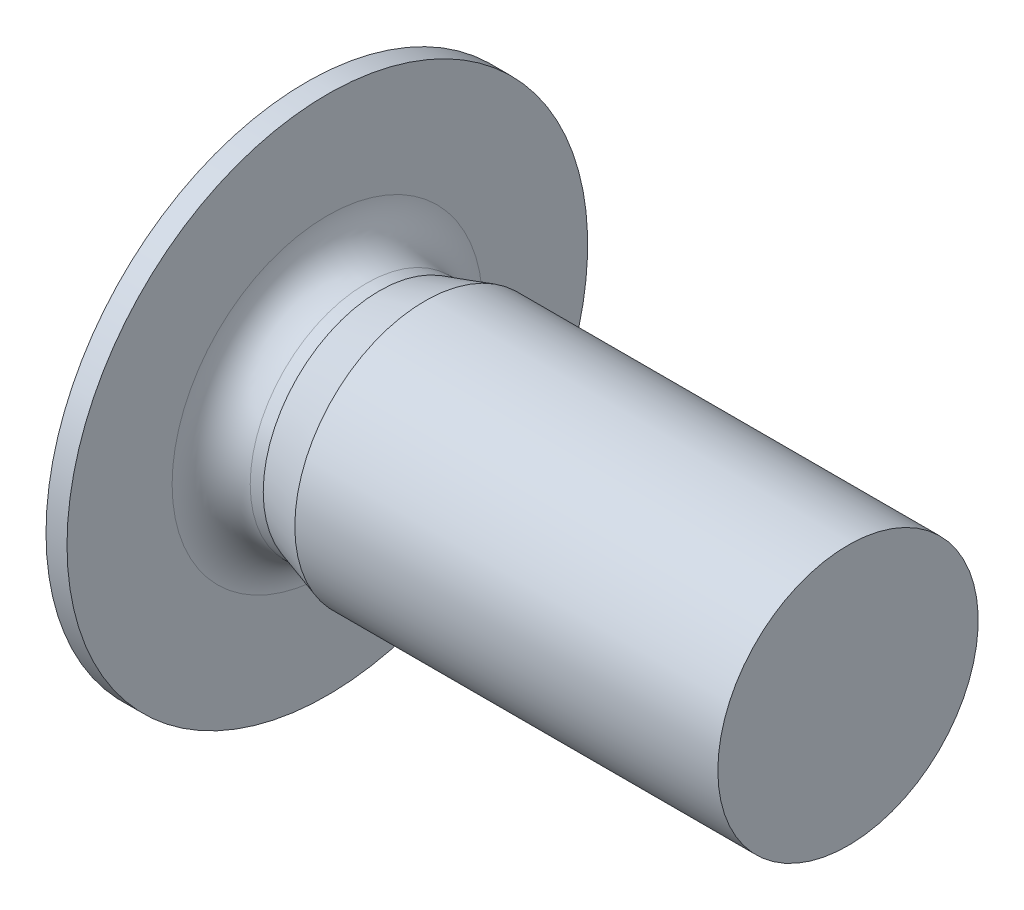
ISO-10303-21;
HEADER;
FILE_DESCRIPTION(('STEP AP214'),'2;1');
FILE_NAME('part.step','',(''),(''),'','','');
FILE_SCHEMA(('AUTOMOTIVE_DESIGN { 1 0 10303 214 1 1 1 1 }'));
ENDSEC;
DATA;
#1=APPLICATION_CONTEXT('core data for automotive mechanical design processes');
#2=APPLICATION_PROTOCOL_DEFINITION('international standard','automotive_design',2000,#1);
#3=PRODUCT_CONTEXT('',#1,'mechanical');
#4=PRODUCT('Part','Part','',(#3));
#5=PRODUCT_RELATED_PRODUCT_CATEGORY('part','',(#4));
#6=PRODUCT_DEFINITION_FORMATION('','',#4);
#7=PRODUCT_DEFINITION_CONTEXT('part definition',#1,'design');
#8=PRODUCT_DEFINITION('design','',#6,#7);
#9=PRODUCT_DEFINITION_SHAPE('','',#8);
#10=(LENGTH_UNIT() NAMED_UNIT(*) SI_UNIT(.MILLI.,.METRE.));
#11=(NAMED_UNIT(*) PLANE_ANGLE_UNIT() SI_UNIT($,.RADIAN.));
#12=(NAMED_UNIT(*) SI_UNIT($,.STERADIAN.) SOLID_ANGLE_UNIT());
#13=UNCERTAINTY_MEASURE_WITH_UNIT(LENGTH_MEASURE(1.E-05),#10,'distance_accuracy_value','');
#14=(GEOMETRIC_REPRESENTATION_CONTEXT(3) GLOBAL_UNCERTAINTY_ASSIGNED_CONTEXT((#13)) GLOBAL_UNIT_ASSIGNED_CONTEXT((#10,
#11,#12)) REPRESENTATION_CONTEXT('',''));
#15=CARTESIAN_POINT('',(0.,0.,0.));
#16=DIRECTION('',(0.,0.,1.));
#17=DIRECTION('',(1.,0.,0.));
#18=AXIS2_PLACEMENT_3D('',#15,#16,#17);
#19=CARTESIAN_POINT('',(0.6,0.,0.));
#20=DIRECTION('',(-1.,0.,0.));
#21=DIRECTION('',(0.,0.,1.));
#22=AXIS2_PLACEMENT_3D('',#19,#20,#21);
#23=TOROIDAL_SURFACE('',#22,2.385,0.6);
#24=CARTESIAN_POINT('',(0.6,0.,0.));
#25=DIRECTION('',(1.,0.,0.));
#26=DIRECTION('',(0.,0.,1.));
#27=AXIS2_PLACEMENT_3D('',#24,#25,#26);
#28=CIRCLE('',#27,1.785);
#29=CARTESIAN_POINT('',(0.6,0.,1.785));
#30=VERTEX_POINT('',#29);
#31=EDGE_CURVE('E205',#30,#30,#28,.T.);
#32=ORIENTED_EDGE('',*,*,#31,.F.);
#33=EDGE_LOOP('',(#32));
#34=FACE_BOUND('',#33,.T.);
#35=CARTESIAN_POINT('',(0.,0.,0.));
#36=DIRECTION('',(-1.,0.,0.));
#37=DIRECTION('',(0.,0.,1.));
#38=AXIS2_PLACEMENT_3D('',#35,#36,#37);
#39=CIRCLE('',#38,2.385);
#40=CARTESIAN_POINT('',(0.,0.,2.385));
#41=VERTEX_POINT('',#40);
#42=EDGE_CURVE('E209',#41,#41,#39,.T.);
#43=ORIENTED_EDGE('',*,*,#42,.F.);
#44=EDGE_LOOP('',(#43));
#45=FACE_BOUND('',#44,.T.);
#46=ADVANCED_FACE('F16',(#34,#45),#23,.F.);
#47=CARTESIAN_POINT('',(0.4,0.,0.));
#48=DIRECTION('',(-1.,0.,0.));
#49=DIRECTION('',(0.,-1.,0.));
#50=AXIS2_PLACEMENT_3D('',#47,#48,#49);
#51=CONICAL_SURFACE('',#50,1.,1.02974425867665);
#52=CARTESIAN_POINT('',(1.00086061902757,0.,0.));
#53=VERTEX_POINT('',#52);
#54=VERTEX_LOOP('',#53);
#55=FACE_BOUND('',#54,.T.);
#56=CARTESIAN_POINT('',(0.4,0.,0.));
#57=DIRECTION('',(1.,0.,0.));
#58=DIRECTION('',(0.,1.,0.));
#59=AXIS2_PLACEMENT_3D('',#56,#57,#58);
#60=CIRCLE('',#59,1.);
#61=CARTESIAN_POINT('',(0.4,1.,0.));
#62=VERTEX_POINT('',#61);
#63=CARTESIAN_POINT('',(0.4,0.5,0.866025403784439));
#64=VERTEX_POINT('',#63);
#65=EDGE_CURVE('E277',#62,#64,#60,.T.);
#66=ORIENTED_EDGE('',*,*,#65,.F.);
#67=CARTESIAN_POINT('',(0.4,0.,0.));
#68=DIRECTION('',(1.,0.,0.));
#69=DIRECTION('',(0.,0.,1.));
#70=AXIS2_PLACEMENT_3D('',#67,#68,#69);
#71=CIRCLE('',#70,1.);
#72=CARTESIAN_POINT('',(0.4,0.5,-0.866025403784439));
#73=VERTEX_POINT('',#72);
#74=EDGE_CURVE('E265',#73,#62,#71,.T.);
#75=ORIENTED_EDGE('',*,*,#74,.F.);
#76=CARTESIAN_POINT('',(0.4,0.,0.));
#77=DIRECTION('',(1.,0.,0.));
#78=DIRECTION('',(0.,0.,1.));
#79=AXIS2_PLACEMENT_3D('',#76,#77,#78);
#80=CIRCLE('',#79,1.);
#81=CARTESIAN_POINT('',(0.4,-0.5,-0.866025403784439));
#82=VERTEX_POINT('',#81);
#83=EDGE_CURVE('E248',#82,#73,#80,.T.);
#84=ORIENTED_EDGE('',*,*,#83,.F.);
#85=CARTESIAN_POINT('',(0.4,0.,0.));
#86=DIRECTION('',(1.,0.,0.));
#87=DIRECTION('',(0.,0.,1.));
#88=AXIS2_PLACEMENT_3D('',#85,#86,#87);
#89=CIRCLE('',#88,1.);
#90=CARTESIAN_POINT('',(0.4,-1.,0.));
#91=VERTEX_POINT('',#90);
#92=EDGE_CURVE('E241',#91,#82,#89,.T.);
#93=ORIENTED_EDGE('',*,*,#92,.F.);
#94=CARTESIAN_POINT('',(0.4,0.,0.));
#95=DIRECTION('',(1.,0.,0.));
#96=DIRECTION('',(0.,0.,1.));
#97=AXIS2_PLACEMENT_3D('',#94,#95,#96);
#98=CIRCLE('',#97,1.);
#99=CARTESIAN_POINT('',(0.4,-0.5,0.866025403784439));
#100=VERTEX_POINT('',#99);
#101=EDGE_CURVE('E297',#100,#91,#98,.T.);
#102=ORIENTED_EDGE('',*,*,#101,.F.);
#103=CARTESIAN_POINT('',(0.4,0.,0.));
#104=DIRECTION('',(1.,0.,0.));
#105=DIRECTION('',(0.,0.,1.));
#106=AXIS2_PLACEMENT_3D('',#103,#104,#105);
#107=CIRCLE('',#106,1.);
#108=EDGE_CURVE('E10',#64,#100,#107,.T.);
#109=ORIENTED_EDGE('',*,*,#108,.F.);
#110=EDGE_LOOP('',(#66,#75,#84,#93,#102,#109));
#111=FACE_BOUND('',#110,.T.);
#112=ADVANCED_FACE('F691',(#55,#111),#51,.F.);
#113=CARTESIAN_POINT('',(0.4,0.,0.));
#114=DIRECTION('',(-1.,0.,0.));
#115=DIRECTION('',(0.,0.,1.));
#116=AXIS2_PLACEMENT_3D('',#113,#114,#115);
#117=PLANE('',#116);
#118=DIRECTION('',(0.,0.866025403784439,-0.5));
#119=VECTOR('',#118,1.);
#120=CARTESIAN_POINT('',(0.4,0.,1.15470053837925));
#121=LINE('',#120,#119);
#122=CARTESIAN_POINT('',(0.4,0.,1.15470053837925));
#123=VERTEX_POINT('',#122);
#124=EDGE_CURVE('E217',#123,#64,#121,.T.);
#125=ORIENTED_EDGE('',*,*,#124,.T.);
#126=ORIENTED_EDGE('',*,*,#108,.T.);
#127=DIRECTION('',(0.,0.866025403784439,0.5));
#128=VECTOR('',#127,1.);
#129=CARTESIAN_POINT('',(0.4,-1.,0.577350269189626));
#130=LINE('',#129,#128);
#131=EDGE_CURVE('E39',#100,#123,#130,.T.);
#132=ORIENTED_EDGE('',*,*,#131,.T.);
#133=EDGE_LOOP('',(#125,#126,#132));
#134=FACE_BOUND('',#133,.T.);
#135=ADVANCED_FACE('F681',(#134),#117,.T.);
#136=CARTESIAN_POINT('',(0.4,0.,-1.15470053837925));
#137=DIRECTION('',(0.,-0.5,-0.866025403784439));
#138=DIRECTION('',(0.,-0.866025403784439,0.5));
#139=AXIS2_PLACEMENT_3D('',#136,#137,#138);
#140=PLANE('',#139);
#141=DIRECTION('',(0.,-0.866025403784439,0.5));
#142=VECTOR('',#141,1.);
#143=CARTESIAN_POINT('',(-0.9,0.,-1.15470053837925));
#144=LINE('',#143,#142);
#145=CARTESIAN_POINT('',(-0.9,0.,-1.15470053837925));
#146=VERTEX_POINT('',#145);
#147=CARTESIAN_POINT('',(-0.9,-1.,-0.577350269189626));
#148=VERTEX_POINT('',#147);
#149=EDGE_CURVE('E148',#146,#148,#144,.T.);
#150=ORIENTED_EDGE('',*,*,#149,.T.);
#151=DIRECTION('',(-1.,0.,0.));
#152=VECTOR('',#151,1.);
#153=CARTESIAN_POINT('',(0.4,-1.,-0.577350269189626));
#154=LINE('',#153,#152);
#155=CARTESIAN_POINT('',(0.4,-1.,-0.577350269189626));
#156=VERTEX_POINT('',#155);
#157=EDGE_CURVE('E24',#156,#148,#154,.T.);
#158=ORIENTED_EDGE('',*,*,#157,.F.);
#159=DIRECTION('',(0.,-0.866025403784439,0.5));
#160=VECTOR('',#159,1.);
#161=CARTESIAN_POINT('',(0.4,0.,-1.15470053837925));
#162=LINE('',#161,#160);
#163=EDGE_CURVE('E237',#82,#156,#162,.T.);
#164=ORIENTED_EDGE('',*,*,#163,.F.);
#165=DIRECTION('',(0.,-0.866025403784439,0.5));
#166=VECTOR('',#165,1.);
#167=CARTESIAN_POINT('',(0.4,0.,-1.15470053837925));
#168=LINE('',#167,#166);
#169=CARTESIAN_POINT('',(0.4,0.,-1.15470053837925));
#170=VERTEX_POINT('',#169);
#171=EDGE_CURVE('E151',#170,#82,#168,.T.);
#172=ORIENTED_EDGE('',*,*,#171,.F.);
#173=DIRECTION('',(-1.,0.,0.));
#174=VECTOR('',#173,1.);
#175=CARTESIAN_POINT('',(0.4,0.,-1.15470053837925));
#176=LINE('',#175,#174);
#177=EDGE_CURVE('E144',#170,#146,#176,.T.);
#178=ORIENTED_EDGE('',*,*,#177,.T.);
#179=EDGE_LOOP('',(#150,#158,#164,#172,#178));
#180=FACE_BOUND('',#179,.T.);
#181=ADVANCED_FACE('F146',(#180),#140,.F.);
#182=CARTESIAN_POINT('',(0.4,-1.,-0.577350269189626));
#183=DIRECTION('',(0.,-1.,0.));
#184=DIRECTION('',(-1.,0.,0.));
#185=AXIS2_PLACEMENT_3D('',#182,#183,#184);
#186=PLANE('',#185);
#187=DIRECTION('',(0.,0.,1.));
#188=VECTOR('',#187,1.);
#189=CARTESIAN_POINT('',(-0.9,-1.,-0.577350269189626));
#190=LINE('',#189,#188);
#191=CARTESIAN_POINT('',(-0.9,-1.,0.577350269189626));
#192=VERTEX_POINT('',#191);
#193=EDGE_CURVE('E174',#148,#192,#190,.T.);
#194=ORIENTED_EDGE('',*,*,#193,.T.);
#195=DIRECTION('',(-1.,0.,0.));
#196=VECTOR('',#195,1.);
#197=CARTESIAN_POINT('',(0.4,-1.,0.577350269189626));
#198=LINE('',#197,#196);
#199=CARTESIAN_POINT('',(0.4,-1.,0.577350269189626));
#200=VERTEX_POINT('',#199);
#201=EDGE_CURVE('E225',#200,#192,#198,.T.);
#202=ORIENTED_EDGE('',*,*,#201,.F.);
#203=DIRECTION('',(0.,0.,1.));
#204=VECTOR('',#203,1.);
#205=CARTESIAN_POINT('',(0.4,-1.,-0.577350269189626));
#206=LINE('',#205,#204);
#207=EDGE_CURVE('E293',#91,#200,#206,.T.);
#208=ORIENTED_EDGE('',*,*,#207,.F.);
#209=DIRECTION('',(0.,0.,1.));
#210=VECTOR('',#209,1.);
#211=CARTESIAN_POINT('',(0.4,-1.,-0.577350269189626));
#212=LINE('',#211,#210);
#213=EDGE_CURVE('E235',#156,#91,#212,.T.);
#214=ORIENTED_EDGE('',*,*,#213,.F.);
#215=ORIENTED_EDGE('',*,*,#157,.T.);
#216=EDGE_LOOP('',(#194,#202,#208,#214,#215));
#217=FACE_BOUND('',#216,.T.);
#218=ADVANCED_FACE('F232',(#217),#186,.F.);
#219=CARTESIAN_POINT('',(0.4,-1.,0.577350269189626));
#220=DIRECTION('',(0.,-0.5,0.866025403784439));
#221=DIRECTION('',(-1.,0.,0.));
#222=AXIS2_PLACEMENT_3D('',#219,#220,#221);
#223=PLANE('',#222);
#224=DIRECTION('',(0.,0.866025403784439,0.5));
#225=VECTOR('',#224,1.);
#226=CARTESIAN_POINT('',(-0.9,-1.,0.577350269189626));
#227=LINE('',#226,#225);
#228=CARTESIAN_POINT('',(-0.9,0.,1.15470053837925));
#229=VERTEX_POINT('',#228);
#230=EDGE_CURVE('E192',#192,#229,#227,.T.);
#231=ORIENTED_EDGE('',*,*,#230,.T.);
#232=DIRECTION('',(-1.,0.,0.));
#233=VECTOR('',#232,1.);
#234=CARTESIAN_POINT('',(0.4,0.,1.15470053837925));
#235=LINE('',#234,#233);
#236=EDGE_CURVE('E220',#123,#229,#235,.T.);
#237=ORIENTED_EDGE('',*,*,#236,.F.);
#238=ORIENTED_EDGE('',*,*,#131,.F.);
#239=DIRECTION('',(0.,0.866025403784439,0.5));
#240=VECTOR('',#239,1.);
#241=CARTESIAN_POINT('',(0.4,-1.,0.577350269189626));
#242=LINE('',#241,#240);
#243=EDGE_CURVE('E301',#200,#100,#242,.T.);
#244=ORIENTED_EDGE('',*,*,#243,.F.);
#245=ORIENTED_EDGE('',*,*,#201,.T.);
#246=EDGE_LOOP('',(#231,#237,#238,#244,#245));
#247=FACE_BOUND('',#246,.T.);
#248=ADVANCED_FACE('F489',(#247),#223,.F.);
#249=CARTESIAN_POINT('',(0.4,0.,1.15470053837925));
#250=DIRECTION('',(0.,0.5,0.866025403784439));
#251=DIRECTION('',(1.,0.,0.));
#252=AXIS2_PLACEMENT_3D('',#249,#250,#251);
#253=PLANE('',#252);
#254=DIRECTION('',(0.,0.866025403784439,-0.5));
#255=VECTOR('',#254,1.);
#256=CARTESIAN_POINT('',(-0.9,0.,1.15470053837925));
#257=LINE('',#256,#255);
#258=CARTESIAN_POINT('',(-0.9,1.,0.577350269189626));
#259=VERTEX_POINT('',#258);
#260=EDGE_CURVE('E188',#229,#259,#257,.T.);
#261=ORIENTED_EDGE('',*,*,#260,.T.);
#262=DIRECTION('',(-1.,0.,0.));
#263=VECTOR('',#262,1.);
#264=CARTESIAN_POINT('',(0.4,1.,0.577350269189626));
#265=LINE('',#264,#263);
#266=CARTESIAN_POINT('',(0.4,1.,0.577350269189626));
#267=VERTEX_POINT('',#266);
#268=EDGE_CURVE('E214',#267,#259,#265,.T.);
#269=ORIENTED_EDGE('',*,*,#268,.F.);
#270=DIRECTION('',(0.,0.866025403784439,-0.5));
#271=VECTOR('',#270,1.);
#272=CARTESIAN_POINT('',(0.4,0.,1.15470053837925));
#273=LINE('',#272,#271);
#274=EDGE_CURVE('E182',#64,#267,#273,.T.);
#275=ORIENTED_EDGE('',*,*,#274,.F.);
#276=ORIENTED_EDGE('',*,*,#124,.F.);
#277=ORIENTED_EDGE('',*,*,#236,.T.);
#278=EDGE_LOOP('',(#261,#269,#275,#276,#277));
#279=FACE_BOUND('',#278,.T.);
#280=ADVANCED_FACE('F521',(#279),#253,.F.);
#281=CARTESIAN_POINT('',(0.4,1.,0.577350269189626));
#282=DIRECTION('',(0.,1.,0.));
#283=DIRECTION('',(1.,0.,0.));
#284=AXIS2_PLACEMENT_3D('',#281,#282,#283);
#285=PLANE('',#284);
#286=DIRECTION('',(0.,0.,-1.));
#287=VECTOR('',#286,1.);
#288=CARTESIAN_POINT('',(-0.9,1.,0.577350269189626));
#289=LINE('',#288,#287);
#290=CARTESIAN_POINT('',(-0.9,1.,-0.577350269189626));
#291=VERTEX_POINT('',#290);
#292=EDGE_CURVE('E167',#259,#291,#289,.T.);
#293=ORIENTED_EDGE('',*,*,#292,.T.);
#294=DIRECTION('',(-1.,0.,0.));
#295=VECTOR('',#294,1.);
#296=CARTESIAN_POINT('',(0.4,1.,-0.577350269189626));
#297=LINE('',#296,#295);
#298=CARTESIAN_POINT('',(0.4,1.,-0.577350269189626));
#299=VERTEX_POINT('',#298);
#300=EDGE_CURVE('E156',#299,#291,#297,.T.);
#301=ORIENTED_EDGE('',*,*,#300,.F.);
#302=DIRECTION('',(0.,0.,-1.));
#303=VECTOR('',#302,1.);
#304=CARTESIAN_POINT('',(0.4,1.,0.577350269189626));
#305=LINE('',#304,#303);
#306=EDGE_CURVE('E269',#62,#299,#305,.T.);
#307=ORIENTED_EDGE('',*,*,#306,.F.);
#308=DIRECTION('',(0.,0.,-1.));
#309=VECTOR('',#308,1.);
#310=CARTESIAN_POINT('',(0.4,1.,0.577350269189626));
#311=LINE('',#310,#309);
#312=EDGE_CURVE('E273',#267,#62,#311,.T.);
#313=ORIENTED_EDGE('',*,*,#312,.F.);
#314=ORIENTED_EDGE('',*,*,#268,.T.);
#315=EDGE_LOOP('',(#293,#301,#307,#313,#314));
#316=FACE_BOUND('',#315,.T.);
#317=ADVANCED_FACE('F517',(#316),#285,.F.);
#318=CARTESIAN_POINT('',(0.4,1.,-0.577350269189626));
#319=DIRECTION('',(0.,0.5,-0.866025403784439));
#320=DIRECTION('',(-1.,0.,0.));
#321=AXIS2_PLACEMENT_3D('',#318,#319,#320);
#322=PLANE('',#321);
#323=DIRECTION('',(0.,-0.866025403784439,-0.5));
#324=VECTOR('',#323,1.);
#325=CARTESIAN_POINT('',(-0.9,1.,-0.577350269189626));
#326=LINE('',#325,#324);
#327=EDGE_CURVE('E160',#291,#146,#326,.T.);
#328=ORIENTED_EDGE('',*,*,#327,.T.);
#329=ORIENTED_EDGE('',*,*,#177,.F.);
#330=DIRECTION('',(0.,-0.866025403784439,-0.5));
#331=VECTOR('',#330,1.);
#332=CARTESIAN_POINT('',(0.4,1.,-0.577350269189626));
#333=LINE('',#332,#331);
#334=EDGE_CURVE('E258',#73,#170,#333,.T.);
#335=ORIENTED_EDGE('',*,*,#334,.F.);
#336=DIRECTION('',(0.,-0.866025403784439,-0.5));
#337=VECTOR('',#336,1.);
#338=CARTESIAN_POINT('',(0.4,1.,-0.577350269189626));
#339=LINE('',#338,#337);
#340=EDGE_CURVE('E261',#299,#73,#339,.T.);
#341=ORIENTED_EDGE('',*,*,#340,.F.);
#342=ORIENTED_EDGE('',*,*,#300,.T.);
#343=EDGE_LOOP('',(#328,#329,#335,#341,#342));
#344=FACE_BOUND('',#343,.T.);
#345=ADVANCED_FACE('F161',(#344),#322,.F.);
#346=CARTESIAN_POINT('',(-0.322649730810373,0.,0.));
#347=DIRECTION('',(1.,0.,0.));
#348=DIRECTION('',(0.,0.,-1.));
#349=AXIS2_PLACEMENT_3D('',#346,#347,#348);
#350=CONICAL_SURFACE('',#349,4.,1.0471975511966);
#351=CARTESIAN_POINT('',(-0.9,0.,0.));
#352=DIRECTION('',(-1.,0.,0.));
#353=DIRECTION('',(0.,0.,1.));
#354=AXIS2_PLACEMENT_3D('',#351,#352,#353);
#355=CIRCLE('',#354,3.);
#356=CARTESIAN_POINT('',(-0.9,0.,3.));
#357=VERTEX_POINT('',#356);
#358=EDGE_CURVE('E176',#357,#357,#355,.T.);
#359=ORIENTED_EDGE('',*,*,#358,.F.);
#360=EDGE_LOOP('',(#359));
#361=FACE_BOUND('',#360,.T.);
#362=CARTESIAN_POINT('',(-0.322649730810373,0.,0.));
#363=DIRECTION('',(-1.,0.,0.));
#364=DIRECTION('',(0.,0.,1.));
#365=AXIS2_PLACEMENT_3D('',#362,#363,#364);
#366=CIRCLE('',#365,4.);
#367=CARTESIAN_POINT('',(-0.322649730810373,0.,4.));
#368=VERTEX_POINT('',#367);
#369=EDGE_CURVE('E157',#368,#368,#366,.T.);
#370=ORIENTED_EDGE('',*,*,#369,.T.);
#371=EDGE_LOOP('',(#370));
#372=FACE_BOUND('',#371,.T.);
#373=ADVANCED_FACE('F534',(#361,#372),#350,.T.);
#374=CARTESIAN_POINT('',(-0.9,0.,0.));
#375=DIRECTION('',(-1.,0.,0.));
#376=DIRECTION('',(0.,0.,1.));
#377=AXIS2_PLACEMENT_3D('',#374,#375,#376);
#378=CYLINDRICAL_SURFACE('',#377,4.);
#379=ORIENTED_EDGE('',*,*,#369,.F.);
#380=EDGE_LOOP('',(#379));
#381=FACE_BOUND('',#380,.T.);
#382=CARTESIAN_POINT('',(0.,0.,0.));
#383=DIRECTION('',(-1.,0.,0.));
#384=DIRECTION('',(0.,0.,1.));
#385=AXIS2_PLACEMENT_3D('',#382,#383,#384);
#386=CIRCLE('',#385,4.);
#387=CARTESIAN_POINT('',(0.,0.,4.));
#388=VERTEX_POINT('',#387);
#389=EDGE_CURVE('E206',#388,#388,#386,.T.);
#390=ORIENTED_EDGE('',*,*,#389,.T.);
#391=EDGE_LOOP('',(#390));
#392=FACE_BOUND('',#391,.T.);
#393=ADVANCED_FACE('F529',(#381,#392),#378,.T.);
#394=CARTESIAN_POINT('',(0.,1.785,0.));
#395=DIRECTION('',(-1.,0.,0.));
#396=DIRECTION('',(0.,0.,1.));
#397=AXIS2_PLACEMENT_3D('',#394,#395,#396);
#398=PLANE('',#397);
#399=ORIENTED_EDGE('',*,*,#42,.T.);
#400=EDGE_LOOP('',(#399));
#401=FACE_BOUND('',#400,.T.);
#402=ORIENTED_EDGE('',*,*,#389,.F.);
#403=EDGE_LOOP('',(#402));
#404=FACE_BOUND('',#403,.T.);
#405=ADVANCED_FACE('F533',(#401,#404),#398,.F.);
#406=CARTESIAN_POINT('',(-0.9,0.,0.));
#407=DIRECTION('',(-1.,0.,0.));
#408=DIRECTION('',(0.,0.,1.));
#409=AXIS2_PLACEMENT_3D('',#406,#407,#408);
#410=CYLINDRICAL_SURFACE('',#409,1.785);
#411=ORIENTED_EDGE('',*,*,#31,.T.);
#412=EDGE_LOOP('',(#411));
#413=FACE_BOUND('',#412,.T.);
#414=CARTESIAN_POINT('',(0.8,0.,0.));
#415=DIRECTION('',(-1.,0.,0.));
#416=DIRECTION('',(0.,0.,1.));
#417=AXIS2_PLACEMENT_3D('',#414,#415,#416);
#418=CIRCLE('',#417,1.785);
#419=CARTESIAN_POINT('',(0.8,0.,1.785));
#420=VERTEX_POINT('',#419);
#421=EDGE_CURVE('E202',#420,#420,#418,.T.);
#422=ORIENTED_EDGE('',*,*,#421,.T.);
#423=EDGE_LOOP('',(#422));
#424=FACE_BOUND('',#423,.T.);
#425=ADVANCED_FACE('F611',(#413,#424),#410,.T.);
#426=CARTESIAN_POINT('',(1.5,0.,0.));
#427=DIRECTION('',(1.,0.,0.));
#428=DIRECTION('',(0.,0.,-1.));
#429=AXIS2_PLACEMENT_3D('',#426,#427,#428);
#430=CONICAL_SURFACE('',#429,2.,0.297996923596221);
#431=ORIENTED_EDGE('',*,*,#421,.F.);
#432=EDGE_LOOP('',(#431));
#433=FACE_BOUND('',#432,.T.);
#434=CARTESIAN_POINT('',(1.5,0.,0.));
#435=DIRECTION('',(-1.,0.,0.));
#436=DIRECTION('',(0.,0.,1.));
#437=AXIS2_PLACEMENT_3D('',#434,#435,#436);
#438=CIRCLE('',#437,2.);
#439=CARTESIAN_POINT('',(1.5,0.,2.));
#440=VERTEX_POINT('',#439);
#441=EDGE_CURVE('E199',#440,#440,#438,.T.);
#442=ORIENTED_EDGE('',*,*,#441,.T.);
#443=EDGE_LOOP('',(#442));
#444=FACE_BOUND('',#443,.T.);
#445=ADVANCED_FACE('F598',(#433,#444),#430,.T.);
#446=CARTESIAN_POINT('',(-0.9,0.,0.));
#447=DIRECTION('',(-1.,0.,0.));
#448=DIRECTION('',(0.,0.,1.));
#449=AXIS2_PLACEMENT_3D('',#446,#447,#448);
#450=CYLINDRICAL_SURFACE('',#449,2.);
#451=ORIENTED_EDGE('',*,*,#441,.F.);
#452=EDGE_LOOP('',(#451));
#453=FACE_BOUND('',#452,.T.);
#454=CARTESIAN_POINT('',(8.,0.,0.));
#455=DIRECTION('',(-1.,0.,0.));
#456=DIRECTION('',(0.,0.,1.));
#457=AXIS2_PLACEMENT_3D('',#454,#455,#456);
#458=CIRCLE('',#457,2.);
#459=CARTESIAN_POINT('',(8.,0.,2.));
#460=VERTEX_POINT('',#459);
#461=EDGE_CURVE('E196',#460,#460,#458,.T.);
#462=ORIENTED_EDGE('',*,*,#461,.T.);
#463=EDGE_LOOP('',(#462));
#464=FACE_BOUND('',#463,.T.);
#465=ADVANCED_FACE('F586',(#453,#464),#450,.T.);
#466=CARTESIAN_POINT('',(8.,0.,0.));
#467=DIRECTION('',(-1.,0.,0.));
#468=DIRECTION('',(0.,0.,1.));
#469=AXIS2_PLACEMENT_3D('',#466,#467,#468);
#470=PLANE('',#469);
#471=ORIENTED_EDGE('',*,*,#461,.F.);
#472=EDGE_LOOP('',(#471));
#473=FACE_BOUND('',#472,.T.);
#474=ADVANCED_FACE('F576',(#473),#470,.F.);
#475=CARTESIAN_POINT('',(-0.9,3.,0.));
#476=DIRECTION('',(1.,0.,0.));
#477=DIRECTION('',(0.,1.,0.));
#478=AXIS2_PLACEMENT_3D('',#475,#476,#477);
#479=PLANE('',#478);
#480=ORIENTED_EDGE('',*,*,#149,.F.);
#481=ORIENTED_EDGE('',*,*,#327,.F.);
#482=ORIENTED_EDGE('',*,*,#292,.F.);
#483=ORIENTED_EDGE('',*,*,#260,.F.);
#484=ORIENTED_EDGE('',*,*,#230,.F.);
#485=ORIENTED_EDGE('',*,*,#193,.F.);
#486=EDGE_LOOP('',(#480,#481,#482,#483,#484,#485));
#487=FACE_BOUND('',#486,.T.);
#488=ORIENTED_EDGE('',*,*,#358,.T.);
#489=EDGE_LOOP('',(#488));
#490=FACE_BOUND('',#489,.T.);
#491=ADVANCED_FACE('F170',(#487,#490),#479,.F.);
#492=CARTESIAN_POINT('',(0.4,0.,0.));
#493=DIRECTION('',(-1.,0.,0.));
#494=DIRECTION('',(0.,0.,1.));
#495=AXIS2_PLACEMENT_3D('',#492,#493,#494);
#496=PLANE('',#495);
#497=ORIENTED_EDGE('',*,*,#312,.T.);
#498=ORIENTED_EDGE('',*,*,#65,.T.);
#499=ORIENTED_EDGE('',*,*,#274,.T.);
#500=EDGE_LOOP('',(#497,#498,#499));
#501=FACE_BOUND('',#500,.T.);
#502=ADVANCED_FACE('F556',(#501),#496,.T.);
#503=CARTESIAN_POINT('',(0.4,0.,0.));
#504=DIRECTION('',(-1.,0.,0.));
#505=DIRECTION('',(0.,0.,1.));
#506=AXIS2_PLACEMENT_3D('',#503,#504,#505);
#507=PLANE('',#506);
#508=ORIENTED_EDGE('',*,*,#340,.T.);
#509=ORIENTED_EDGE('',*,*,#74,.T.);
#510=ORIENTED_EDGE('',*,*,#306,.T.);
#511=EDGE_LOOP('',(#508,#509,#510));
#512=FACE_BOUND('',#511,.T.);
#513=ADVANCED_FACE('F545',(#512),#507,.T.);
#514=CARTESIAN_POINT('',(0.4,0.,0.));
#515=DIRECTION('',(-1.,0.,0.));
#516=DIRECTION('',(0.,0.,1.));
#517=AXIS2_PLACEMENT_3D('',#514,#515,#516);
#518=PLANE('',#517);
#519=ORIENTED_EDGE('',*,*,#171,.T.);
#520=ORIENTED_EDGE('',*,*,#83,.T.);
#521=ORIENTED_EDGE('',*,*,#334,.T.);
#522=EDGE_LOOP('',(#519,#520,#521));
#523=FACE_BOUND('',#522,.T.);
#524=ADVANCED_FACE('F510',(#523),#518,.T.);
#525=CARTESIAN_POINT('',(0.4,0.,0.));
#526=DIRECTION('',(-1.,0.,0.));
#527=DIRECTION('',(0.,0.,1.));
#528=AXIS2_PLACEMENT_3D('',#525,#526,#527);
#529=PLANE('',#528);
#530=ORIENTED_EDGE('',*,*,#213,.T.);
#531=ORIENTED_EDGE('',*,*,#92,.T.);
#532=ORIENTED_EDGE('',*,*,#163,.T.);
#533=EDGE_LOOP('',(#530,#531,#532));
#534=FACE_BOUND('',#533,.T.);
#535=ADVANCED_FACE('F240',(#534),#529,.T.);
#536=CARTESIAN_POINT('',(0.4,0.,0.));
#537=DIRECTION('',(-1.,0.,0.));
#538=DIRECTION('',(0.,0.,1.));
#539=AXIS2_PLACEMENT_3D('',#536,#537,#538);
#540=PLANE('',#539);
#541=ORIENTED_EDGE('',*,*,#243,.T.);
#542=ORIENTED_EDGE('',*,*,#101,.T.);
#543=ORIENTED_EDGE('',*,*,#207,.T.);
#544=EDGE_LOOP('',(#541,#542,#543));
#545=FACE_BOUND('',#544,.T.);
#546=ADVANCED_FACE('F496',(#545),#540,.T.);
#547=CLOSED_SHELL('',(#46,#112,#135,#181,#218,#248,#280,#317,#345,#373,#393,#405,#425,#445,#465,
#474,#491,#502,#513,#524,#535,#546));
#548=MANIFOLD_SOLID_BREP('B1',#547);
#549=ADVANCED_BREP_SHAPE_REPRESENTATION('',(#18,#548),#14);
#550=SHAPE_DEFINITION_REPRESENTATION(#9,#549);
ENDSEC;
END-ISO-10303-21;
